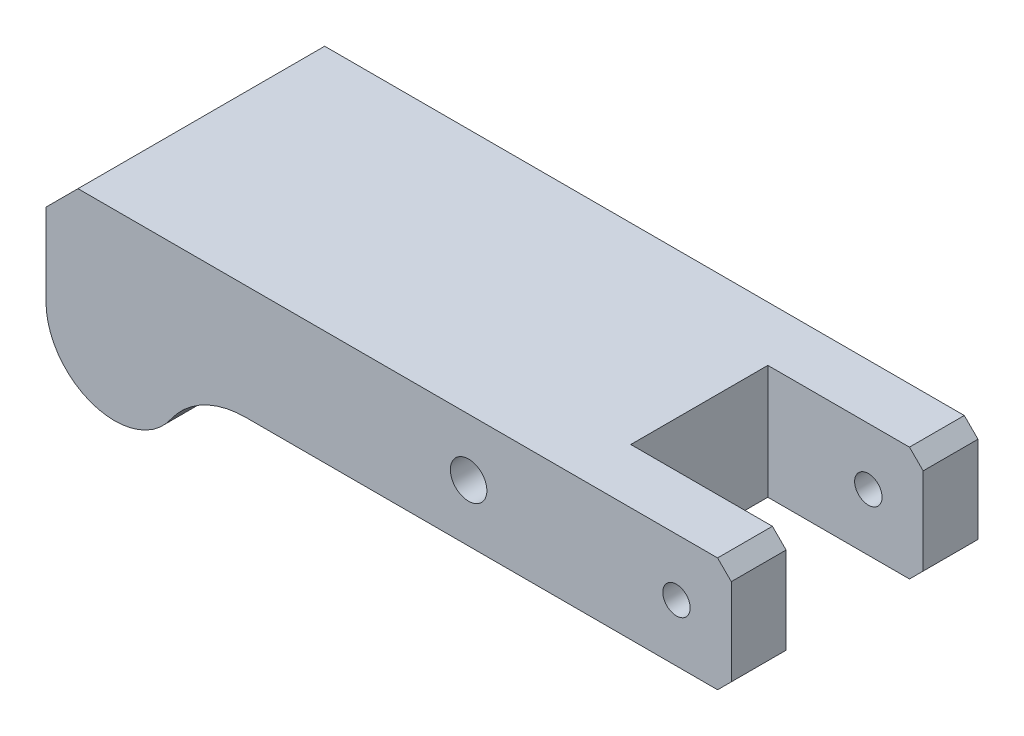
ISO-10303-21;
HEADER;
FILE_DESCRIPTION(('STEP AP214'),'2;1');
FILE_NAME('part.step','',(''),(''),'','','');
FILE_SCHEMA(('AUTOMOTIVE_DESIGN { 1 0 10303 214 1 1 1 1 }'));
ENDSEC;
DATA;
#1=APPLICATION_CONTEXT('core data for automotive mechanical design processes');
#2=APPLICATION_PROTOCOL_DEFINITION('international standard','automotive_design',2000,#1);
#3=PRODUCT_CONTEXT('',#1,'mechanical');
#4=PRODUCT('Part','Part','',(#3));
#5=PRODUCT_RELATED_PRODUCT_CATEGORY('part','',(#4));
#6=PRODUCT_DEFINITION_FORMATION('','',#4);
#7=PRODUCT_DEFINITION_CONTEXT('part definition',#1,'design');
#8=PRODUCT_DEFINITION('design','',#6,#7);
#9=PRODUCT_DEFINITION_SHAPE('','',#8);
#10=(LENGTH_UNIT() NAMED_UNIT(*) SI_UNIT(.MILLI.,.METRE.));
#11=(NAMED_UNIT(*) PLANE_ANGLE_UNIT() SI_UNIT($,.RADIAN.));
#12=(NAMED_UNIT(*) SI_UNIT($,.STERADIAN.) SOLID_ANGLE_UNIT());
#13=UNCERTAINTY_MEASURE_WITH_UNIT(LENGTH_MEASURE(1.E-05),#10,'distance_accuracy_value','');
#14=(GEOMETRIC_REPRESENTATION_CONTEXT(3) GLOBAL_UNCERTAINTY_ASSIGNED_CONTEXT((#13)) GLOBAL_UNIT_ASSIGNED_CONTEXT((#10,
#11,#12)) REPRESENTATION_CONTEXT('',''));
#15=CARTESIAN_POINT('',(0.,0.,0.));
#16=DIRECTION('',(0.,0.,1.));
#17=DIRECTION('',(1.,0.,0.));
#18=AXIS2_PLACEMENT_3D('',#15,#16,#17);
#19=CARTESIAN_POINT('',(87.4017857142857,0.,54.));
#20=DIRECTION('',(-0.707106781186547,0.707106781186548,0.));
#21=DIRECTION('',(-0.707106781186548,-0.707106781186547,0.));
#22=AXIS2_PLACEMENT_3D('',#19,#20,#21);
#23=PLANE('',#22);
#24=DIRECTION('',(0.,0.,-1.));
#25=VECTOR('',#24,1.);
#26=CARTESIAN_POINT('',(87.4017857142857,0.,54.));
#27=LINE('',#26,#25);
#28=CARTESIAN_POINT('',(87.4017857142857,0.,54.));
#29=VERTEX_POINT('',#28);
#30=CARTESIAN_POINT('',(87.4017857142857,0.,42.));
#31=VERTEX_POINT('',#30);
#32=EDGE_CURVE('E211',#29,#31,#27,.T.);
#33=ORIENTED_EDGE('',*,*,#32,.T.);
#34=DIRECTION('',(0.707106781186548,0.707106781186547,0.));
#35=VECTOR('',#34,1.);
#36=CARTESIAN_POINT('',(87.4017857142857,0.,42.));
#37=LINE('',#36,#35);
#38=CARTESIAN_POINT('',(90.4017857142857,3.,42.));
#39=VERTEX_POINT('',#38);
#40=EDGE_CURVE('E259',#31,#39,#37,.T.);
#41=ORIENTED_EDGE('',*,*,#40,.T.);
#42=DIRECTION('',(0.,0.,-1.));
#43=VECTOR('',#42,1.);
#44=CARTESIAN_POINT('',(90.4017857142857,3.,54.));
#45=LINE('',#44,#43);
#46=CARTESIAN_POINT('',(90.4017857142857,3.,54.));
#47=VERTEX_POINT('',#46);
#48=EDGE_CURVE('E206',#47,#39,#45,.T.);
#49=ORIENTED_EDGE('',*,*,#48,.F.);
#50=DIRECTION('',(0.707106781186548,0.707106781186547,0.));
#51=VECTOR('',#50,1.);
#52=CARTESIAN_POINT('',(87.4017857142857,0.,54.));
#53=LINE('',#52,#51);
#54=EDGE_CURVE('E293',#29,#47,#53,.T.);
#55=ORIENTED_EDGE('',*,*,#54,.F.);
#56=EDGE_LOOP('',(#33,#41,#49,#55));
#57=FACE_BOUND('',#56,.T.);
#58=ADVANCED_FACE('F39',(#57),#23,.F.);
#59=CARTESIAN_POINT('',(90.4017857142857,22.,54.));
#60=DIRECTION('',(-1.,0.,0.));
#61=DIRECTION('',(0.,0.,1.));
#62=AXIS2_PLACEMENT_3D('',#59,#60,#61);
#63=PLANE('',#62);
#64=ORIENTED_EDGE('',*,*,#48,.T.);
#65=DIRECTION('',(0.,1.,0.));
#66=VECTOR('',#65,1.);
#67=CARTESIAN_POINT('',(90.4017857142857,-29.,42.));
#68=LINE('',#67,#66);
#69=CARTESIAN_POINT('',(90.4017857142857,22.,42.));
#70=VERTEX_POINT('',#69);
#71=EDGE_CURVE('E220',#39,#70,#68,.T.);
#72=ORIENTED_EDGE('',*,*,#71,.T.);
#73=DIRECTION('',(0.,0.,-1.));
#74=VECTOR('',#73,1.);
#75=CARTESIAN_POINT('',(90.4017857142857,22.,54.));
#76=LINE('',#75,#74);
#77=CARTESIAN_POINT('',(90.4017857142857,22.,54.));
#78=VERTEX_POINT('',#77);
#79=EDGE_CURVE('E201',#78,#70,#76,.T.);
#80=ORIENTED_EDGE('',*,*,#79,.F.);
#81=DIRECTION('',(0.,1.,0.));
#82=VECTOR('',#81,1.);
#83=CARTESIAN_POINT('',(90.4017857142857,22.,54.));
#84=LINE('',#83,#82);
#85=EDGE_CURVE('E296',#47,#78,#84,.T.);
#86=ORIENTED_EDGE('',*,*,#85,.F.);
#87=EDGE_LOOP('',(#64,#72,#80,#86));
#88=FACE_BOUND('',#87,.T.);
#89=ADVANCED_FACE('F323',(#88),#63,.F.);
#90=CARTESIAN_POINT('',(87.4017857142857,25.,54.));
#91=DIRECTION('',(-0.707106781186546,-0.707106781186549,0.));
#92=DIRECTION('',(0.707106781186549,-0.707106781186546,0.));
#93=AXIS2_PLACEMENT_3D('',#90,#91,#92);
#94=PLANE('',#93);
#95=ORIENTED_EDGE('',*,*,#79,.T.);
#96=DIRECTION('',(-0.707106781186549,0.707106781186546,0.));
#97=VECTOR('',#96,1.);
#98=CARTESIAN_POINT('',(87.4017857142857,25.,42.));
#99=LINE('',#98,#97);
#100=CARTESIAN_POINT('',(87.4017857142857,25.,42.));
#101=VERTEX_POINT('',#100);
#102=EDGE_CURVE('E255',#70,#101,#99,.T.);
#103=ORIENTED_EDGE('',*,*,#102,.T.);
#104=DIRECTION('',(0.,0.,-1.));
#105=VECTOR('',#104,1.);
#106=CARTESIAN_POINT('',(87.4017857142857,25.,54.));
#107=LINE('',#106,#105);
#108=CARTESIAN_POINT('',(87.4017857142857,25.,54.));
#109=VERTEX_POINT('',#108);
#110=EDGE_CURVE('E197',#109,#101,#107,.T.);
#111=ORIENTED_EDGE('',*,*,#110,.F.);
#112=DIRECTION('',(-0.707106781186549,0.707106781186546,0.));
#113=VECTOR('',#112,1.);
#114=CARTESIAN_POINT('',(87.4017857142857,25.,54.));
#115=LINE('',#114,#113);
#116=EDGE_CURVE('E136',#78,#109,#115,.T.);
#117=ORIENTED_EDGE('',*,*,#116,.F.);
#118=EDGE_LOOP('',(#95,#103,#111,#117));
#119=FACE_BOUND('',#118,.T.);
#120=ADVANCED_FACE('F309',(#119),#94,.F.);
#121=CARTESIAN_POINT('',(78.4017857142857,12.5,54.));
#122=DIRECTION('',(0.,0.,-1.));
#123=DIRECTION('',(-1.,0.,0.));
#124=AXIS2_PLACEMENT_3D('',#121,#122,#123);
#125=CYLINDRICAL_SURFACE('',#124,3.00000000000001);
#126=CARTESIAN_POINT('',(78.4017857142857,12.5,42.));
#127=DIRECTION('',(0.,0.,1.));
#128=DIRECTION('',(1.,0.,0.));
#129=AXIS2_PLACEMENT_3D('',#126,#127,#128);
#130=CIRCLE('',#129,3.00000000000001);
#131=CARTESIAN_POINT('',(81.4017857142857,12.5,42.));
#132=VERTEX_POINT('',#131);
#133=EDGE_CURVE('E43',#132,#132,#130,.T.);
#134=ORIENTED_EDGE('',*,*,#133,.F.);
#135=EDGE_LOOP('',(#134));
#136=FACE_BOUND('',#135,.T.);
#137=CARTESIAN_POINT('',(78.4017857142857,12.5,54.));
#138=DIRECTION('',(0.,0.,1.));
#139=DIRECTION('',(1.,0.,0.));
#140=AXIS2_PLACEMENT_3D('',#137,#138,#139);
#141=CIRCLE('',#140,3.00000000000001);
#142=CARTESIAN_POINT('',(81.4017857142857,12.5,54.));
#143=VERTEX_POINT('',#142);
#144=EDGE_CURVE('E166',#143,#143,#141,.T.);
#145=ORIENTED_EDGE('',*,*,#144,.T.);
#146=EDGE_LOOP('',(#145));
#147=FACE_BOUND('',#146,.T.);
#148=ADVANCED_FACE('F306',(#136,#147),#125,.F.);
#149=CARTESIAN_POINT('',(-44.5982142857143,0.,54.));
#150=DIRECTION('',(0.,0.,1.));
#151=DIRECTION('',(1.,0.,0.));
#152=AXIS2_PLACEMENT_3D('',#149,#150,#151);
#153=PLANE('',#152);
#154=ORIENTED_EDGE('',*,*,#144,.F.);
#155=EDGE_LOOP('',(#154));
#156=FACE_BOUND('',#155,.T.);
#157=CARTESIAN_POINT('',(-44.5982142857143,0.,54.));
#158=DIRECTION('',(0.,0.,1.));
#159=DIRECTION('',(1.,0.,0.));
#160=AXIS2_PLACEMENT_3D('',#157,#158,#159);
#161=CIRCLE('',#160,15.);
#162=CARTESIAN_POINT('',(-59.5982142857143,0.,54.));
#163=VERTEX_POINT('',#162);
#164=CARTESIAN_POINT('',(-32.2884371859899,-8.57142857142857,54.));
#165=VERTEX_POINT('',#164);
#166=EDGE_CURVE('E192',#163,#165,#161,.T.);
#167=ORIENTED_EDGE('',*,*,#166,.T.);
#168=CARTESIAN_POINT('',(-15.8754010530241,-20.,54.));
#169=DIRECTION('',(0.,0.,-1.));
#170=DIRECTION('',(-1.,0.,0.));
#171=AXIS2_PLACEMENT_3D('',#168,#169,#170);
#172=CIRCLE('',#171,20.);
#173=CARTESIAN_POINT('',(-15.8754010530241,0.,54.));
#174=VERTEX_POINT('',#173);
#175=EDGE_CURVE('E110',#165,#174,#172,.T.);
#176=ORIENTED_EDGE('',*,*,#175,.T.);
#177=DIRECTION('',(1.,0.,0.));
#178=VECTOR('',#177,1.);
#179=CARTESIAN_POINT('',(-15.8754010530241,0.,54.));
#180=LINE('',#179,#178);
#181=EDGE_CURVE('E290',#174,#29,#180,.T.);
#182=ORIENTED_EDGE('',*,*,#181,.T.);
#183=ORIENTED_EDGE('',*,*,#54,.T.);
#184=ORIENTED_EDGE('',*,*,#85,.T.);
#185=ORIENTED_EDGE('',*,*,#116,.T.);
#186=DIRECTION('',(-1.,0.,0.));
#187=VECTOR('',#186,1.);
#188=CARTESIAN_POINT('',(-52.5982142857143,25.,54.));
#189=LINE('',#188,#187);
#190=CARTESIAN_POINT('',(-52.5982142857143,25.,54.));
#191=VERTEX_POINT('',#190);
#192=EDGE_CURVE('E128',#109,#191,#189,.T.);
#193=ORIENTED_EDGE('',*,*,#192,.T.);
#194=DIRECTION('',(-0.707106781186549,-0.707106781186546,0.));
#195=VECTOR('',#194,1.);
#196=CARTESIAN_POINT('',(-59.5982142857143,18.,54.));
#197=LINE('',#196,#195);
#198=CARTESIAN_POINT('',(-59.5982142857143,18.,54.));
#199=VERTEX_POINT('',#198);
#200=EDGE_CURVE('E133',#191,#199,#197,.T.);
#201=ORIENTED_EDGE('',*,*,#200,.T.);
#202=DIRECTION('',(0.,-1.,0.));
#203=VECTOR('',#202,1.);
#204=CARTESIAN_POINT('',(-59.5982142857143,18.,54.));
#205=LINE('',#204,#203);
#206=EDGE_CURVE('E66',#199,#163,#205,.T.);
#207=ORIENTED_EDGE('',*,*,#206,.T.);
#208=EDGE_LOOP('',(#167,#176,#182,#183,#184,#185,#193,#201,#207));
#209=FACE_BOUND('',#208,.T.);
#210=CARTESIAN_POINT('',(32.9017857142857,12.5,54.));
#211=DIRECTION('',(0.,0.,1.));
#212=DIRECTION('',(1.,0.,0.));
#213=AXIS2_PLACEMENT_3D('',#210,#211,#212);
#214=CIRCLE('',#213,4.00000000000001);
#215=CARTESIAN_POINT('',(36.9017857142857,12.5,54.));
#216=VERTEX_POINT('',#215);
#217=EDGE_CURVE('E272',#216,#216,#214,.T.);
#218=ORIENTED_EDGE('',*,*,#217,.F.);
#219=EDGE_LOOP('',(#218));
#220=FACE_BOUND('',#219,.T.);
#221=ADVANCED_FACE('F130',(#156,#209,#220),#153,.T.);
#222=CARTESIAN_POINT('',(-44.5982142857143,0.,0.));
#223=DIRECTION('',(0.,0.,1.));
#224=DIRECTION('',(1.,0.,0.));
#225=AXIS2_PLACEMENT_3D('',#222,#223,#224);
#226=PLANE('',#225);
#227=CARTESIAN_POINT('',(-44.5982142857143,0.,0.));
#228=DIRECTION('',(0.,0.,1.));
#229=DIRECTION('',(1.,0.,0.));
#230=AXIS2_PLACEMENT_3D('',#227,#228,#229);
#231=CIRCLE('',#230,15.);
#232=CARTESIAN_POINT('',(-59.5982142857143,0.,0.));
#233=VERTEX_POINT('',#232);
#234=CARTESIAN_POINT('',(-32.2884371859899,-8.57142857142857,0.));
#235=VERTEX_POINT('',#234);
#236=EDGE_CURVE('E161',#233,#235,#231,.T.);
#237=ORIENTED_EDGE('',*,*,#236,.F.);
#238=DIRECTION('',(0.,-1.,0.));
#239=VECTOR('',#238,1.);
#240=CARTESIAN_POINT('',(-59.5982142857143,18.,0.));
#241=LINE('',#240,#239);
#242=CARTESIAN_POINT('',(-59.5982142857143,18.,0.));
#243=VERTEX_POINT('',#242);
#244=EDGE_CURVE('E102',#243,#233,#241,.T.);
#245=ORIENTED_EDGE('',*,*,#244,.F.);
#246=DIRECTION('',(-0.707106781186549,-0.707106781186546,0.));
#247=VECTOR('',#246,1.);
#248=CARTESIAN_POINT('',(-59.5982142857143,18.,0.));
#249=LINE('',#248,#247);
#250=CARTESIAN_POINT('',(-52.5982142857143,25.,0.));
#251=VERTEX_POINT('',#250);
#252=EDGE_CURVE('E187',#251,#243,#249,.T.);
#253=ORIENTED_EDGE('',*,*,#252,.F.);
#254=DIRECTION('',(-1.,0.,0.));
#255=VECTOR('',#254,1.);
#256=CARTESIAN_POINT('',(-52.5982142857143,25.,0.));
#257=LINE('',#256,#255);
#258=CARTESIAN_POINT('',(87.4017857142857,25.,0.));
#259=VERTEX_POINT('',#258);
#260=EDGE_CURVE('E146',#259,#251,#257,.T.);
#261=ORIENTED_EDGE('',*,*,#260,.F.);
#262=DIRECTION('',(-0.707106781186549,0.707106781186546,0.));
#263=VECTOR('',#262,1.);
#264=CARTESIAN_POINT('',(87.4017857142857,25.,0.));
#265=LINE('',#264,#263);
#266=CARTESIAN_POINT('',(90.4017857142857,22.,0.));
#267=VERTEX_POINT('',#266);
#268=EDGE_CURVE('E181',#267,#259,#265,.T.);
#269=ORIENTED_EDGE('',*,*,#268,.F.);
#270=DIRECTION('',(0.,1.,0.));
#271=VECTOR('',#270,1.);
#272=CARTESIAN_POINT('',(90.4017857142857,22.,0.));
#273=LINE('',#272,#271);
#274=CARTESIAN_POINT('',(90.4017857142857,3.,0.));
#275=VERTEX_POINT('',#274);
#276=EDGE_CURVE('E177',#275,#267,#273,.T.);
#277=ORIENTED_EDGE('',*,*,#276,.F.);
#278=DIRECTION('',(0.707106781186548,0.707106781186547,0.));
#279=VECTOR('',#278,1.);
#280=CARTESIAN_POINT('',(87.4017857142857,0.,0.));
#281=LINE('',#280,#279);
#282=CARTESIAN_POINT('',(87.4017857142857,0.,0.));
#283=VERTEX_POINT('',#282);
#284=EDGE_CURVE('E173',#283,#275,#281,.T.);
#285=ORIENTED_EDGE('',*,*,#284,.F.);
#286=DIRECTION('',(1.,0.,0.));
#287=VECTOR('',#286,1.);
#288=CARTESIAN_POINT('',(-15.8754010530241,0.,0.));
#289=LINE('',#288,#287);
#290=CARTESIAN_POINT('',(-15.8754010530241,0.,0.));
#291=VERTEX_POINT('',#290);
#292=EDGE_CURVE('E169',#291,#283,#289,.T.);
#293=ORIENTED_EDGE('',*,*,#292,.F.);
#294=CARTESIAN_POINT('',(-15.8754010530241,-20.,0.));
#295=DIRECTION('',(0.,0.,-1.));
#296=DIRECTION('',(-1.,0.,0.));
#297=AXIS2_PLACEMENT_3D('',#294,#295,#296);
#298=CIRCLE('',#297,20.);
#299=EDGE_CURVE('E165',#235,#291,#298,.T.);
#300=ORIENTED_EDGE('',*,*,#299,.F.);
#301=EDGE_LOOP('',(#237,#245,#253,#261,#269,#277,#285,#293,#300));
#302=FACE_BOUND('',#301,.T.);
#303=CARTESIAN_POINT('',(78.4017857142857,12.5,0.));
#304=DIRECTION('',(0.,0.,1.));
#305=DIRECTION('',(1.,0.,0.));
#306=AXIS2_PLACEMENT_3D('',#303,#304,#305);
#307=CIRCLE('',#306,3.00000000000001);
#308=CARTESIAN_POINT('',(81.4017857142857,12.5,0.));
#309=VERTEX_POINT('',#308);
#310=EDGE_CURVE('E276',#309,#309,#307,.T.);
#311=ORIENTED_EDGE('',*,*,#310,.T.);
#312=EDGE_LOOP('',(#311));
#313=FACE_BOUND('',#312,.T.);
#314=CARTESIAN_POINT('',(32.9017857142857,12.5,0.));
#315=DIRECTION('',(0.,0.,1.));
#316=DIRECTION('',(1.,0.,0.));
#317=AXIS2_PLACEMENT_3D('',#314,#315,#316);
#318=CIRCLE('',#317,4.00000000000001);
#319=CARTESIAN_POINT('',(36.9017857142857,12.5,0.));
#320=VERTEX_POINT('',#319);
#321=EDGE_CURVE('E271',#320,#320,#318,.T.);
#322=ORIENTED_EDGE('',*,*,#321,.T.);
#323=EDGE_LOOP('',(#322));
#324=FACE_BOUND('',#323,.T.);
#325=ADVANCED_FACE('F315',(#302,#313,#324),#226,.F.);
#326=CARTESIAN_POINT('',(-44.5982142857143,0.,54.));
#327=DIRECTION('',(0.,0.,-1.));
#328=DIRECTION('',(-1.,0.,0.));
#329=AXIS2_PLACEMENT_3D('',#326,#327,#328);
#330=CYLINDRICAL_SURFACE('',#329,15.);
#331=ORIENTED_EDGE('',*,*,#236,.T.);
#332=DIRECTION('',(0.,0.,-1.));
#333=VECTOR('',#332,1.);
#334=CARTESIAN_POINT('',(-32.2884371859899,-8.57142857142857,54.));
#335=LINE('',#334,#333);
#336=EDGE_CURVE('E11',#165,#235,#335,.T.);
#337=ORIENTED_EDGE('',*,*,#336,.F.);
#338=ORIENTED_EDGE('',*,*,#166,.F.);
#339=DIRECTION('',(0.,0.,-1.));
#340=VECTOR('',#339,1.);
#341=CARTESIAN_POINT('',(-59.5982142857143,0.,54.));
#342=LINE('',#341,#340);
#343=EDGE_CURVE('E157',#163,#233,#342,.T.);
#344=ORIENTED_EDGE('',*,*,#343,.T.);
#345=EDGE_LOOP('',(#331,#337,#338,#344));
#346=FACE_BOUND('',#345,.T.);
#347=ADVANCED_FACE('F41',(#346),#330,.T.);
#348=CARTESIAN_POINT('',(-15.8754010530241,-20.,54.));
#349=DIRECTION('',(0.,0.,-1.));
#350=DIRECTION('',(-1.,0.,0.));
#351=AXIS2_PLACEMENT_3D('',#348,#349,#350);
#352=CYLINDRICAL_SURFACE('',#351,20.);
#353=ORIENTED_EDGE('',*,*,#299,.T.);
#354=DIRECTION('',(0.,0.,-1.));
#355=VECTOR('',#354,1.);
#356=CARTESIAN_POINT('',(-15.8754010530241,0.,54.));
#357=LINE('',#356,#355);
#358=EDGE_CURVE('E49',#174,#291,#357,.T.);
#359=ORIENTED_EDGE('',*,*,#358,.F.);
#360=ORIENTED_EDGE('',*,*,#175,.F.);
#361=ORIENTED_EDGE('',*,*,#336,.T.);
#362=EDGE_LOOP('',(#353,#359,#360,#361));
#363=FACE_BOUND('',#362,.T.);
#364=ADVANCED_FACE('F342',(#363),#352,.F.);
#365=CARTESIAN_POINT('',(-15.8754010530241,0.,54.));
#366=DIRECTION('',(0.,1.,0.));
#367=DIRECTION('',(0.,0.,1.));
#368=AXIS2_PLACEMENT_3D('',#365,#366,#367);
#369=PLANE('',#368);
#370=DIRECTION('',(0.,0.,1.));
#371=VECTOR('',#370,1.);
#372=CARTESIAN_POINT('',(56.4017857142857,0.,54.));
#373=LINE('',#372,#371);
#374=CARTESIAN_POINT('',(56.4017857142857,0.,12.));
#375=VERTEX_POINT('',#374);
#376=CARTESIAN_POINT('',(56.4017857142857,0.,42.));
#377=VERTEX_POINT('',#376);
#378=EDGE_CURVE('E267',#375,#377,#373,.T.);
#379=ORIENTED_EDGE('',*,*,#378,.T.);
#380=DIRECTION('',(1.,0.,0.));
#381=VECTOR('',#380,1.);
#382=CARTESIAN_POINT('',(-15.8754010530241,0.,42.));
#383=LINE('',#382,#381);
#384=EDGE_CURVE('E263',#377,#31,#383,.T.);
#385=ORIENTED_EDGE('',*,*,#384,.T.);
#386=ORIENTED_EDGE('',*,*,#32,.F.);
#387=ORIENTED_EDGE('',*,*,#181,.F.);
#388=ORIENTED_EDGE('',*,*,#358,.T.);
#389=ORIENTED_EDGE('',*,*,#292,.T.);
#390=CARTESIAN_POINT('',(87.4017857142857,0.,12.));
#391=VERTEX_POINT('',#390);
#392=EDGE_CURVE('E210',#391,#283,#27,.T.);
#393=ORIENTED_EDGE('',*,*,#392,.F.);
#394=DIRECTION('',(-1.,0.,0.));
#395=VECTOR('',#394,1.);
#396=CARTESIAN_POINT('',(-15.8754010530241,0.,12.));
#397=LINE('',#396,#395);
#398=EDGE_CURVE('E251',#391,#375,#397,.T.);
#399=ORIENTED_EDGE('',*,*,#398,.T.);
#400=EDGE_LOOP('',(#379,#385,#386,#387,#388,#389,#393,#399));
#401=FACE_BOUND('',#400,.T.);
#402=ADVANCED_FACE('F334',(#401),#369,.F.);
#403=CARTESIAN_POINT('',(90.4017857142857,3.,12.));
#404=VERTEX_POINT('',#403);
#405=EDGE_CURVE('E205',#404,#275,#45,.T.);
#406=ORIENTED_EDGE('',*,*,#405,.F.);
#407=DIRECTION('',(-0.707106781186548,-0.707106781186547,0.));
#408=VECTOR('',#407,1.);
#409=CARTESIAN_POINT('',(87.4017857142857,0.,12.));
#410=LINE('',#409,#408);
#411=EDGE_CURVE('E225',#404,#391,#410,.T.);
#412=ORIENTED_EDGE('',*,*,#411,.T.);
#413=ORIENTED_EDGE('',*,*,#392,.T.);
#414=ORIENTED_EDGE('',*,*,#284,.T.);
#415=EDGE_LOOP('',(#406,#412,#413,#414));
#416=FACE_BOUND('',#415,.T.);
#417=ADVANCED_FACE('F326',(#416),#23,.F.);
#418=CARTESIAN_POINT('',(90.4017857142857,22.,12.));
#419=VERTEX_POINT('',#418);
#420=EDGE_CURVE('E200',#419,#267,#76,.T.);
#421=ORIENTED_EDGE('',*,*,#420,.F.);
#422=DIRECTION('',(0.,1.,0.));
#423=VECTOR('',#422,1.);
#424=CARTESIAN_POINT('',(90.4017857142857,-29.,12.));
#425=LINE('',#424,#423);
#426=EDGE_CURVE('E245',#404,#419,#425,.T.);
#427=ORIENTED_EDGE('',*,*,#426,.F.);
#428=ORIENTED_EDGE('',*,*,#405,.T.);
#429=ORIENTED_EDGE('',*,*,#276,.T.);
#430=EDGE_LOOP('',(#421,#427,#428,#429));
#431=FACE_BOUND('',#430,.T.);
#432=ADVANCED_FACE('F331',(#431),#63,.F.);
#433=CARTESIAN_POINT('',(87.4017857142857,25.,12.));
#434=VERTEX_POINT('',#433);
#435=EDGE_CURVE('E150',#434,#259,#107,.T.);
#436=ORIENTED_EDGE('',*,*,#435,.F.);
#437=DIRECTION('',(0.707106781186549,-0.707106781186546,0.));
#438=VECTOR('',#437,1.);
#439=CARTESIAN_POINT('',(87.4017857142857,25.,12.));
#440=LINE('',#439,#438);
#441=EDGE_CURVE('E57',#434,#419,#440,.T.);
#442=ORIENTED_EDGE('',*,*,#441,.T.);
#443=ORIENTED_EDGE('',*,*,#420,.T.);
#444=ORIENTED_EDGE('',*,*,#268,.T.);
#445=EDGE_LOOP('',(#436,#442,#443,#444));
#446=FACE_BOUND('',#445,.T.);
#447=ADVANCED_FACE('F340',(#446),#94,.F.);
#448=CARTESIAN_POINT('',(-52.5982142857143,25.,54.));
#449=DIRECTION('',(0.,-1.,0.));
#450=DIRECTION('',(0.,0.,-1.));
#451=AXIS2_PLACEMENT_3D('',#448,#449,#450);
#452=PLANE('',#451);
#453=ORIENTED_EDGE('',*,*,#110,.T.);
#454=DIRECTION('',(1.,0.,0.));
#455=VECTOR('',#454,1.);
#456=CARTESIAN_POINT('',(90.4017857142857,25.,42.));
#457=LINE('',#456,#455);
#458=CARTESIAN_POINT('',(56.4017857142857,25.,42.));
#459=VERTEX_POINT('',#458);
#460=EDGE_CURVE('E239',#459,#101,#457,.T.);
#461=ORIENTED_EDGE('',*,*,#460,.F.);
#462=DIRECTION('',(0.,0.,1.));
#463=VECTOR('',#462,1.);
#464=CARTESIAN_POINT('',(56.4017857142857,25.,12.));
#465=LINE('',#464,#463);
#466=CARTESIAN_POINT('',(56.4017857142857,25.,12.));
#467=VERTEX_POINT('',#466);
#468=EDGE_CURVE('E399',#467,#459,#465,.T.);
#469=ORIENTED_EDGE('',*,*,#468,.F.);
#470=DIRECTION('',(-1.,0.,0.));
#471=VECTOR('',#470,1.);
#472=CARTESIAN_POINT('',(90.4017857142857,25.,12.));
#473=LINE('',#472,#471);
#474=EDGE_CURVE('E361',#434,#467,#473,.T.);
#475=ORIENTED_EDGE('',*,*,#474,.F.);
#476=ORIENTED_EDGE('',*,*,#435,.T.);
#477=ORIENTED_EDGE('',*,*,#260,.T.);
#478=DIRECTION('',(0.,0.,-1.));
#479=VECTOR('',#478,1.);
#480=CARTESIAN_POINT('',(-52.5982142857143,25.,54.));
#481=LINE('',#480,#479);
#482=EDGE_CURVE('E143',#191,#251,#481,.T.);
#483=ORIENTED_EDGE('',*,*,#482,.F.);
#484=ORIENTED_EDGE('',*,*,#192,.F.);
#485=EDGE_LOOP('',(#453,#461,#469,#475,#476,#477,#483,#484));
#486=FACE_BOUND('',#485,.T.);
#487=ADVANCED_FACE('F144',(#486),#452,.F.);
#488=CARTESIAN_POINT('',(-59.5982142857143,18.,54.));
#489=DIRECTION('',(0.707106781186546,-0.707106781186549,0.));
#490=DIRECTION('',(0.707106781186549,0.707106781186546,0.));
#491=AXIS2_PLACEMENT_3D('',#488,#489,#490);
#492=PLANE('',#491);
#493=ORIENTED_EDGE('',*,*,#252,.T.);
#494=DIRECTION('',(0.,0.,-1.));
#495=VECTOR('',#494,1.);
#496=CARTESIAN_POINT('',(-59.5982142857143,18.,54.));
#497=LINE('',#496,#495);
#498=EDGE_CURVE('E151',#199,#243,#497,.T.);
#499=ORIENTED_EDGE('',*,*,#498,.F.);
#500=ORIENTED_EDGE('',*,*,#200,.F.);
#501=ORIENTED_EDGE('',*,*,#482,.T.);
#502=EDGE_LOOP('',(#493,#499,#500,#501));
#503=FACE_BOUND('',#502,.T.);
#504=ADVANCED_FACE('F153',(#503),#492,.F.);
#505=CARTESIAN_POINT('',(-59.5982142857143,18.,54.));
#506=DIRECTION('',(1.,0.,0.));
#507=DIRECTION('',(0.,0.,-1.));
#508=AXIS2_PLACEMENT_3D('',#505,#506,#507);
#509=PLANE('',#508);
#510=ORIENTED_EDGE('',*,*,#244,.T.);
#511=ORIENTED_EDGE('',*,*,#343,.F.);
#512=ORIENTED_EDGE('',*,*,#206,.F.);
#513=ORIENTED_EDGE('',*,*,#498,.T.);
#514=EDGE_LOOP('',(#510,#511,#512,#513));
#515=FACE_BOUND('',#514,.T.);
#516=ADVANCED_FACE('F367',(#515),#509,.F.);
#517=CARTESIAN_POINT('',(78.4017857142857,12.5,12.));
#518=DIRECTION('',(0.,0.,-1.));
#519=DIRECTION('',(-1.,0.,0.));
#520=AXIS2_PLACEMENT_3D('',#517,#518,#519);
#521=CIRCLE('',#520,3.00000000000001);
#522=CARTESIAN_POINT('',(75.4017857142857,12.5,12.));
#523=VERTEX_POINT('',#522);
#524=EDGE_CURVE('E217',#523,#523,#521,.T.);
#525=ORIENTED_EDGE('',*,*,#524,.F.);
#526=EDGE_LOOP('',(#525));
#527=FACE_BOUND('',#526,.T.);
#528=ORIENTED_EDGE('',*,*,#310,.F.);
#529=EDGE_LOOP('',(#528));
#530=FACE_BOUND('',#529,.T.);
#531=ADVANCED_FACE('F311',(#527,#530),#125,.F.);
#532=CARTESIAN_POINT('',(32.9017857142857,12.5,54.));
#533=DIRECTION('',(0.,0.,-1.));
#534=DIRECTION('',(-1.,0.,0.));
#535=AXIS2_PLACEMENT_3D('',#532,#533,#534);
#536=CYLINDRICAL_SURFACE('',#535,4.00000000000001);
#537=ORIENTED_EDGE('',*,*,#217,.T.);
#538=EDGE_LOOP('',(#537));
#539=FACE_BOUND('',#538,.T.);
#540=ORIENTED_EDGE('',*,*,#321,.F.);
#541=EDGE_LOOP('',(#540));
#542=FACE_BOUND('',#541,.T.);
#543=ADVANCED_FACE('F417',(#539,#542),#536,.F.);
#544=CARTESIAN_POINT('',(56.4017857142857,-29.,12.));
#545=DIRECTION('',(-1.,0.,0.));
#546=DIRECTION('',(0.,0.,1.));
#547=AXIS2_PLACEMENT_3D('',#544,#545,#546);
#548=PLANE('',#547);
#549=DIRECTION('',(0.,1.,0.));
#550=VECTOR('',#549,1.);
#551=CARTESIAN_POINT('',(56.4017857142857,-29.,12.));
#552=LINE('',#551,#550);
#553=EDGE_CURVE('E236',#375,#467,#552,.T.);
#554=ORIENTED_EDGE('',*,*,#553,.T.);
#555=ORIENTED_EDGE('',*,*,#468,.T.);
#556=DIRECTION('',(0.,1.,0.));
#557=VECTOR('',#556,1.);
#558=CARTESIAN_POINT('',(56.4017857142857,-29.,42.));
#559=LINE('',#558,#557);
#560=EDGE_CURVE('E228',#377,#459,#559,.T.);
#561=ORIENTED_EDGE('',*,*,#560,.F.);
#562=ORIENTED_EDGE('',*,*,#378,.F.);
#563=EDGE_LOOP('',(#554,#555,#561,#562));
#564=FACE_BOUND('',#563,.T.);
#565=ADVANCED_FACE('F397',(#564),#548,.F.);
#566=CARTESIAN_POINT('',(90.4017857142857,-29.,42.));
#567=DIRECTION('',(0.,0.,1.));
#568=DIRECTION('',(1.,0.,0.));
#569=AXIS2_PLACEMENT_3D('',#566,#567,#568);
#570=PLANE('',#569);
#571=ORIENTED_EDGE('',*,*,#133,.T.);
#572=EDGE_LOOP('',(#571));
#573=FACE_BOUND('',#572,.T.);
#574=ORIENTED_EDGE('',*,*,#560,.T.);
#575=ORIENTED_EDGE('',*,*,#460,.T.);
#576=ORIENTED_EDGE('',*,*,#102,.F.);
#577=ORIENTED_EDGE('',*,*,#71,.F.);
#578=ORIENTED_EDGE('',*,*,#40,.F.);
#579=ORIENTED_EDGE('',*,*,#384,.F.);
#580=EDGE_LOOP('',(#574,#575,#576,#577,#578,#579));
#581=FACE_BOUND('',#580,.T.);
#582=ADVANCED_FACE('F303',(#573,#581),#570,.F.);
#583=CARTESIAN_POINT('',(90.4017857142857,-29.,12.));
#584=DIRECTION('',(0.,0.,-1.));
#585=DIRECTION('',(-1.,0.,0.));
#586=AXIS2_PLACEMENT_3D('',#583,#584,#585);
#587=PLANE('',#586);
#588=ORIENTED_EDGE('',*,*,#524,.T.);
#589=EDGE_LOOP('',(#588));
#590=FACE_BOUND('',#589,.T.);
#591=ORIENTED_EDGE('',*,*,#411,.F.);
#592=ORIENTED_EDGE('',*,*,#426,.T.);
#593=ORIENTED_EDGE('',*,*,#441,.F.);
#594=ORIENTED_EDGE('',*,*,#474,.T.);
#595=ORIENTED_EDGE('',*,*,#553,.F.);
#596=ORIENTED_EDGE('',*,*,#398,.F.);
#597=EDGE_LOOP('',(#591,#592,#593,#594,#595,#596));
#598=FACE_BOUND('',#597,.T.);
#599=ADVANCED_FACE('F400',(#590,#598),#587,.F.);
#600=CLOSED_SHELL('',(#58,#89,#120,#148,#221,#325,#347,#364,#402,#417,#432,#447,#487,#504,#516,
#531,#543,#565,#582,#599));
#601=MANIFOLD_SOLID_BREP('B2',#600);
#602=ADVANCED_BREP_SHAPE_REPRESENTATION('',(#18,#601),#14);
#603=SHAPE_DEFINITION_REPRESENTATION(#9,#602);
ENDSEC;
END-ISO-10303-21;
